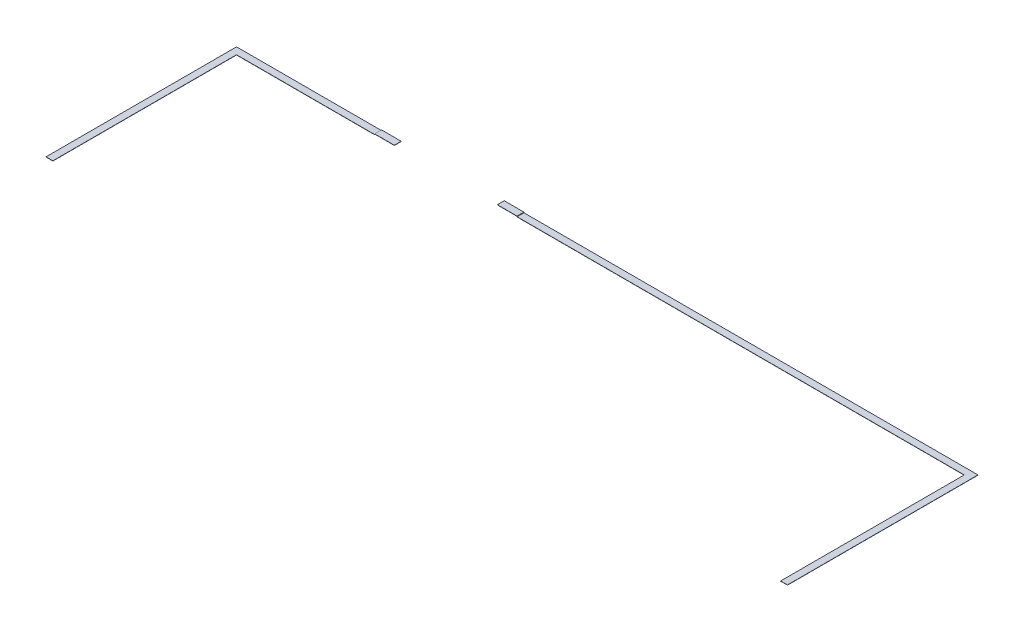
ISO-10303-21;
HEADER;
FILE_DESCRIPTION(('STEP AP214'),'2;1');
FILE_NAME('part.step','',(''),(''),'','','');
FILE_SCHEMA(('AUTOMOTIVE_DESIGN { 1 0 10303 214 1 1 1 1 }'));
ENDSEC;
DATA;
#1=APPLICATION_CONTEXT('core data for automotive mechanical design processes');
#2=APPLICATION_PROTOCOL_DEFINITION('international standard','automotive_design',2000,#1);
#3=PRODUCT_CONTEXT('',#1,'mechanical');
#4=PRODUCT('Part','Part','',(#3));
#5=PRODUCT_RELATED_PRODUCT_CATEGORY('part','',(#4));
#6=PRODUCT_DEFINITION_FORMATION('','',#4);
#7=PRODUCT_DEFINITION_CONTEXT('part definition',#1,'design');
#8=PRODUCT_DEFINITION('design','',#6,#7);
#9=PRODUCT_DEFINITION_SHAPE('','',#8);
#10=(LENGTH_UNIT() NAMED_UNIT(*) SI_UNIT(.MILLI.,.METRE.));
#11=(NAMED_UNIT(*) PLANE_ANGLE_UNIT() SI_UNIT($,.RADIAN.));
#12=(NAMED_UNIT(*) SI_UNIT($,.STERADIAN.) SOLID_ANGLE_UNIT());
#13=UNCERTAINTY_MEASURE_WITH_UNIT(LENGTH_MEASURE(1.E-05),#10,'distance_accuracy_value','');
#14=(GEOMETRIC_REPRESENTATION_CONTEXT(3) GLOBAL_UNCERTAINTY_ASSIGNED_CONTEXT((#13)) GLOBAL_UNIT_ASSIGNED_CONTEXT((#10,
#11,#12)) REPRESENTATION_CONTEXT('',''));
#15=CARTESIAN_POINT('',(0.,0.,0.));
#16=DIRECTION('',(0.,0.,1.));
#17=DIRECTION('',(1.,0.,0.));
#18=AXIS2_PLACEMENT_3D('',#15,#16,#17);
#19=CARTESIAN_POINT('',(2126.7166,5.8293,-1409.7));
#20=DIRECTION('',(1.,0.,0.));
#21=DIRECTION('',(0.,0.,-1.));
#22=AXIS2_PLACEMENT_3D('',#19,#20,#21);
#23=PLANE('',#22);
#24=DIRECTION('',(0.,0.,1.));
#25=VECTOR('',#24,1.);
#26=CARTESIAN_POINT('',(2126.7166,4.2418,-1409.7));
#27=LINE('',#26,#25);
#28=CARTESIAN_POINT('',(2126.7166,4.2418,-1409.7));
#29=VERTEX_POINT('',#28);
#30=CARTESIAN_POINT('',(2126.7166,4.2418,-1358.9));
#31=VERTEX_POINT('',#30);
#32=EDGE_CURVE('E110',#29,#31,#27,.T.);
#33=ORIENTED_EDGE('',*,*,#32,.F.);
#34=DIRECTION('',(0.,-1.,0.));
#35=VECTOR('',#34,1.);
#36=CARTESIAN_POINT('',(2126.7166,5.8293,-1409.7));
#37=LINE('',#36,#35);
#38=CARTESIAN_POINT('',(2126.7166,5.8293,-1409.7));
#39=VERTEX_POINT('',#38);
#40=EDGE_CURVE('E12',#39,#29,#37,.T.);
#41=ORIENTED_EDGE('',*,*,#40,.F.);
#42=DIRECTION('',(0.,0.,1.));
#43=VECTOR('',#42,1.);
#44=CARTESIAN_POINT('',(2126.7166,5.8293,-1409.7));
#45=LINE('',#44,#43);
#46=CARTESIAN_POINT('',(2126.7166,5.8293,-1358.9));
#47=VERTEX_POINT('',#46);
#48=EDGE_CURVE('E104',#39,#47,#45,.T.);
#49=ORIENTED_EDGE('',*,*,#48,.T.);
#50=DIRECTION('',(0.,-1.,0.));
#51=VECTOR('',#50,1.);
#52=CARTESIAN_POINT('',(2126.7166,5.8293,-1358.9));
#53=LINE('',#52,#51);
#54=EDGE_CURVE('E49',#47,#31,#53,.T.);
#55=ORIENTED_EDGE('',*,*,#54,.T.);
#56=EDGE_LOOP('',(#33,#41,#49,#55));
#57=FACE_BOUND('',#56,.T.);
#58=ADVANCED_FACE('F46',(#57),#23,.T.);
#59=CARTESIAN_POINT('',(2126.7166,5.8293,-1409.7));
#60=DIRECTION('',(0.,0.,-1.));
#61=DIRECTION('',(-1.,0.,0.));
#62=AXIS2_PLACEMENT_3D('',#59,#60,#61);
#63=PLANE('',#62);
#64=DIRECTION('',(1.,0.,0.));
#65=VECTOR('',#64,1.);
#66=CARTESIAN_POINT('',(2126.7166,4.2418,-1409.7));
#67=LINE('',#66,#65);
#68=CARTESIAN_POINT('',(1980.6666,4.2418,-1409.7));
#69=VERTEX_POINT('',#68);
#70=EDGE_CURVE('E106',#69,#29,#67,.T.);
#71=ORIENTED_EDGE('',*,*,#70,.F.);
#72=DIRECTION('',(0.,-1.,0.));
#73=VECTOR('',#72,1.);
#74=CARTESIAN_POINT('',(1980.6666,5.8293,-1409.7));
#75=LINE('',#74,#73);
#76=CARTESIAN_POINT('',(1980.6666,5.8293,-1409.7));
#77=VERTEX_POINT('',#76);
#78=EDGE_CURVE('E55',#77,#69,#75,.T.);
#79=ORIENTED_EDGE('',*,*,#78,.F.);
#80=DIRECTION('',(1.,0.,0.));
#81=VECTOR('',#80,1.);
#82=CARTESIAN_POINT('',(2126.7166,5.8293,-1409.7));
#83=LINE('',#82,#81);
#84=EDGE_CURVE('E101',#77,#39,#83,.T.);
#85=ORIENTED_EDGE('',*,*,#84,.T.);
#86=ORIENTED_EDGE('',*,*,#40,.T.);
#87=EDGE_LOOP('',(#71,#79,#85,#86));
#88=FACE_BOUND('',#87,.T.);
#89=ADVANCED_FACE('F120',(#88),#63,.T.);
#90=CARTESIAN_POINT('',(1980.6666,5.8293,-1409.7));
#91=DIRECTION('',(-1.,0.,0.));
#92=DIRECTION('',(0.,0.,1.));
#93=AXIS2_PLACEMENT_3D('',#90,#91,#92);
#94=PLANE('',#93);
#95=DIRECTION('',(0.,0.,-1.));
#96=VECTOR('',#95,1.);
#97=CARTESIAN_POINT('',(1980.6666,4.2418,-1409.7));
#98=LINE('',#97,#96);
#99=CARTESIAN_POINT('',(1980.6666,4.2418,-1358.9));
#100=VERTEX_POINT('',#99);
#101=EDGE_CURVE('E96',#100,#69,#98,.T.);
#102=ORIENTED_EDGE('',*,*,#101,.F.);
#103=DIRECTION('',(0.,-1.,0.));
#104=VECTOR('',#103,1.);
#105=CARTESIAN_POINT('',(1980.6666,5.8293,-1358.9));
#106=LINE('',#105,#104);
#107=CARTESIAN_POINT('',(1980.6666,5.8293,-1358.9));
#108=VERTEX_POINT('',#107);
#109=EDGE_CURVE('E91',#108,#100,#106,.T.);
#110=ORIENTED_EDGE('',*,*,#109,.F.);
#111=DIRECTION('',(0.,0.,-1.));
#112=VECTOR('',#111,1.);
#113=CARTESIAN_POINT('',(1980.6666,5.8293,-1409.7));
#114=LINE('',#113,#112);
#115=EDGE_CURVE('E94',#108,#77,#114,.T.);
#116=ORIENTED_EDGE('',*,*,#115,.T.);
#117=ORIENTED_EDGE('',*,*,#78,.T.);
#118=EDGE_LOOP('',(#102,#110,#116,#117));
#119=FACE_BOUND('',#118,.T.);
#120=ADVANCED_FACE('F93',(#119),#94,.T.);
#121=CARTESIAN_POINT('',(2126.7166,5.8293,-1358.9));
#122=DIRECTION('',(0.,0.,1.));
#123=DIRECTION('',(1.,0.,0.));
#124=AXIS2_PLACEMENT_3D('',#121,#122,#123);
#125=PLANE('',#124);
#126=DIRECTION('',(-1.,0.,0.));
#127=VECTOR('',#126,1.);
#128=CARTESIAN_POINT('',(2126.7166,4.2418,-1358.9));
#129=LINE('',#128,#127);
#130=EDGE_CURVE('E113',#31,#100,#129,.T.);
#131=ORIENTED_EDGE('',*,*,#130,.F.);
#132=ORIENTED_EDGE('',*,*,#54,.F.);
#133=DIRECTION('',(-1.,0.,0.));
#134=VECTOR('',#133,1.);
#135=CARTESIAN_POINT('',(2126.7166,5.8293,-1358.9));
#136=LINE('',#135,#134);
#137=EDGE_CURVE('E100',#47,#108,#136,.T.);
#138=ORIENTED_EDGE('',*,*,#137,.T.);
#139=ORIENTED_EDGE('',*,*,#109,.T.);
#140=EDGE_LOOP('',(#131,#132,#138,#139));
#141=FACE_BOUND('',#140,.T.);
#142=ADVANCED_FACE('F103',(#141),#125,.T.);
#143=CARTESIAN_POINT('',(0.,5.8293,0.));
#144=DIRECTION('',(0.,-1.,0.));
#145=DIRECTION('',(0.,0.,-1.));
#146=AXIS2_PLACEMENT_3D('',#143,#144,#145);
#147=PLANE('',#146);
#148=ORIENTED_EDGE('',*,*,#48,.F.);
#149=ORIENTED_EDGE('',*,*,#84,.F.);
#150=ORIENTED_EDGE('',*,*,#115,.F.);
#151=ORIENTED_EDGE('',*,*,#137,.F.);
#152=EDGE_LOOP('',(#148,#149,#150,#151));
#153=FACE_BOUND('',#152,.T.);
#154=ADVANCED_FACE('F99',(#153),#147,.F.);
#155=CARTESIAN_POINT('',(0.,4.2418,0.));
#156=DIRECTION('',(0.,-1.,0.));
#157=DIRECTION('',(0.,0.,-1.));
#158=AXIS2_PLACEMENT_3D('',#155,#156,#157);
#159=PLANE('',#158);
#160=ORIENTED_EDGE('',*,*,#32,.T.);
#161=ORIENTED_EDGE('',*,*,#130,.T.);
#162=ORIENTED_EDGE('',*,*,#101,.T.);
#163=ORIENTED_EDGE('',*,*,#70,.T.);
#164=EDGE_LOOP('',(#160,#161,#162,#163));
#165=FACE_BOUND('',#164,.T.);
#166=ADVANCED_FACE('F119',(#165),#159,.T.);
#167=CLOSED_SHELL('',(#58,#89,#120,#142,#154,#166));
#168=MANIFOLD_SOLID_BREP('B2',#167);
#169=CARTESIAN_POINT('',(1072.6166,5.8293,-1409.7));
#170=DIRECTION('',(-1.,0.,0.));
#171=DIRECTION('',(0.,0.,1.));
#172=AXIS2_PLACEMENT_3D('',#169,#170,#171);
#173=PLANE('',#172);
#174=DIRECTION('',(0.,0.,-1.));
#175=VECTOR('',#174,1.);
#176=CARTESIAN_POINT('',(1072.6166,4.2418,-1409.7));
#177=LINE('',#176,#175);
#178=CARTESIAN_POINT('',(1072.6166,4.2418,-1358.9));
#179=VERTEX_POINT('',#178);
#180=CARTESIAN_POINT('',(1072.6166,4.2418,-1409.7));
#181=VERTEX_POINT('',#180);
#182=EDGE_CURVE('E244',#179,#181,#177,.T.);
#183=ORIENTED_EDGE('',*,*,#182,.F.);
#184=DIRECTION('',(0.,-1.,0.));
#185=VECTOR('',#184,1.);
#186=CARTESIAN_POINT('',(1072.6166,5.8293,-1358.9));
#187=LINE('',#186,#185);
#188=CARTESIAN_POINT('',(1072.6166,5.8293,-1358.9));
#189=VERTEX_POINT('',#188);
#190=EDGE_CURVE('E44',#189,#179,#187,.T.);
#191=ORIENTED_EDGE('',*,*,#190,.F.);
#192=DIRECTION('',(0.,0.,-1.));
#193=VECTOR('',#192,1.);
#194=CARTESIAN_POINT('',(1072.6166,5.8293,-1409.7));
#195=LINE('',#194,#193);
#196=CARTESIAN_POINT('',(1072.6166,5.8293,-1409.7));
#197=VERTEX_POINT('',#196);
#198=EDGE_CURVE('E238',#189,#197,#195,.T.);
#199=ORIENTED_EDGE('',*,*,#198,.T.);
#200=DIRECTION('',(0.,-1.,0.));
#201=VECTOR('',#200,1.);
#202=CARTESIAN_POINT('',(1072.6166,5.8293,-1409.7));
#203=LINE('',#202,#201);
#204=EDGE_CURVE('E183',#197,#181,#203,.T.);
#205=ORIENTED_EDGE('',*,*,#204,.T.);
#206=EDGE_LOOP('',(#183,#191,#199,#205));
#207=FACE_BOUND('',#206,.T.);
#208=ADVANCED_FACE('F180',(#207),#173,.T.);
#209=CARTESIAN_POINT('',(1072.6166,5.8293,-1358.9));
#210=DIRECTION('',(0.,0.,1.));
#211=DIRECTION('',(1.,0.,0.));
#212=AXIS2_PLACEMENT_3D('',#209,#210,#211);
#213=PLANE('',#212);
#214=DIRECTION('',(-1.,0.,0.));
#215=VECTOR('',#214,1.);
#216=CARTESIAN_POINT('',(1072.6166,4.2418,-1358.9));
#217=LINE('',#216,#215);
#218=CARTESIAN_POINT('',(1218.6666,4.2418,-1358.9));
#219=VERTEX_POINT('',#218);
#220=EDGE_CURVE('E240',#219,#179,#217,.T.);
#221=ORIENTED_EDGE('',*,*,#220,.F.);
#222=DIRECTION('',(0.,-1.,0.));
#223=VECTOR('',#222,1.);
#224=CARTESIAN_POINT('',(1218.6666,5.8293,-1358.9));
#225=LINE('',#224,#223);
#226=CARTESIAN_POINT('',(1218.6666,5.8293,-1358.9));
#227=VERTEX_POINT('',#226);
#228=EDGE_CURVE('E189',#227,#219,#225,.T.);
#229=ORIENTED_EDGE('',*,*,#228,.F.);
#230=DIRECTION('',(-1.,0.,0.));
#231=VECTOR('',#230,1.);
#232=CARTESIAN_POINT('',(1072.6166,5.8293,-1358.9));
#233=LINE('',#232,#231);
#234=EDGE_CURVE('E235',#227,#189,#233,.T.);
#235=ORIENTED_EDGE('',*,*,#234,.T.);
#236=ORIENTED_EDGE('',*,*,#190,.T.);
#237=EDGE_LOOP('',(#221,#229,#235,#236));
#238=FACE_BOUND('',#237,.T.);
#239=ADVANCED_FACE('F254',(#238),#213,.T.);
#240=CARTESIAN_POINT('',(1218.6666,5.8293,-1409.7));
#241=DIRECTION('',(1.,0.,0.));
#242=DIRECTION('',(0.,0.,-1.));
#243=AXIS2_PLACEMENT_3D('',#240,#241,#242);
#244=PLANE('',#243);
#245=DIRECTION('',(0.,0.,1.));
#246=VECTOR('',#245,1.);
#247=CARTESIAN_POINT('',(1218.6666,4.2418,-1409.7));
#248=LINE('',#247,#246);
#249=CARTESIAN_POINT('',(1218.6666,4.2418,-1409.7));
#250=VERTEX_POINT('',#249);
#251=EDGE_CURVE('E230',#250,#219,#248,.T.);
#252=ORIENTED_EDGE('',*,*,#251,.F.);
#253=DIRECTION('',(0.,-1.,0.));
#254=VECTOR('',#253,1.);
#255=CARTESIAN_POINT('',(1218.6666,5.8293,-1409.7));
#256=LINE('',#255,#254);
#257=CARTESIAN_POINT('',(1218.6666,5.8293,-1409.7));
#258=VERTEX_POINT('',#257);
#259=EDGE_CURVE('E225',#258,#250,#256,.T.);
#260=ORIENTED_EDGE('',*,*,#259,.F.);
#261=DIRECTION('',(0.,0.,1.));
#262=VECTOR('',#261,1.);
#263=CARTESIAN_POINT('',(1218.6666,5.8293,-1409.7));
#264=LINE('',#263,#262);
#265=EDGE_CURVE('E228',#258,#227,#264,.T.);
#266=ORIENTED_EDGE('',*,*,#265,.T.);
#267=ORIENTED_EDGE('',*,*,#228,.T.);
#268=EDGE_LOOP('',(#252,#260,#266,#267));
#269=FACE_BOUND('',#268,.T.);
#270=ADVANCED_FACE('F227',(#269),#244,.T.);
#271=CARTESIAN_POINT('',(1072.6166,5.8293,-1409.7));
#272=DIRECTION('',(0.,0.,-1.));
#273=DIRECTION('',(-1.,0.,0.));
#274=AXIS2_PLACEMENT_3D('',#271,#272,#273);
#275=PLANE('',#274);
#276=DIRECTION('',(1.,0.,0.));
#277=VECTOR('',#276,1.);
#278=CARTESIAN_POINT('',(1072.6166,4.2418,-1409.7));
#279=LINE('',#278,#277);
#280=EDGE_CURVE('E247',#181,#250,#279,.T.);
#281=ORIENTED_EDGE('',*,*,#280,.F.);
#282=ORIENTED_EDGE('',*,*,#204,.F.);
#283=DIRECTION('',(1.,0.,0.));
#284=VECTOR('',#283,1.);
#285=CARTESIAN_POINT('',(1072.6166,5.8293,-1409.7));
#286=LINE('',#285,#284);
#287=EDGE_CURVE('E234',#197,#258,#286,.T.);
#288=ORIENTED_EDGE('',*,*,#287,.T.);
#289=ORIENTED_EDGE('',*,*,#259,.T.);
#290=EDGE_LOOP('',(#281,#282,#288,#289));
#291=FACE_BOUND('',#290,.T.);
#292=ADVANCED_FACE('F237',(#291),#275,.T.);
#293=CARTESIAN_POINT('',(0.,5.8293,0.));
#294=DIRECTION('',(0.,1.,0.));
#295=DIRECTION('',(0.,0.,1.));
#296=AXIS2_PLACEMENT_3D('',#293,#294,#295);
#297=PLANE('',#296);
#298=ORIENTED_EDGE('',*,*,#198,.F.);
#299=ORIENTED_EDGE('',*,*,#234,.F.);
#300=ORIENTED_EDGE('',*,*,#265,.F.);
#301=ORIENTED_EDGE('',*,*,#287,.F.);
#302=EDGE_LOOP('',(#298,#299,#300,#301));
#303=FACE_BOUND('',#302,.T.);
#304=ADVANCED_FACE('F233',(#303),#297,.T.);
#305=CARTESIAN_POINT('',(0.,4.2418,0.));
#306=DIRECTION('',(0.,1.,0.));
#307=DIRECTION('',(0.,0.,1.));
#308=AXIS2_PLACEMENT_3D('',#305,#306,#307);
#309=PLANE('',#308);
#310=ORIENTED_EDGE('',*,*,#182,.T.);
#311=ORIENTED_EDGE('',*,*,#280,.T.);
#312=ORIENTED_EDGE('',*,*,#251,.T.);
#313=ORIENTED_EDGE('',*,*,#220,.T.);
#314=EDGE_LOOP('',(#310,#311,#312,#313));
#315=FACE_BOUND('',#314,.T.);
#316=ADVANCED_FACE('F253',(#315),#309,.F.);
#317=CLOSED_SHELL('',(#208,#239,#270,#292,#304,#316));
#318=MANIFOLD_SOLID_BREP('B6',#317);
#319=CARTESIAN_POINT('',(5435.6,1.5875,-1358.9));
#320=DIRECTION('',(1.,0.,0.));
#321=DIRECTION('',(0.,0.,-1.));
#322=AXIS2_PLACEMENT_3D('',#319,#320,#321);
#323=PLANE('',#322);
#324=DIRECTION('',(0.,0.,1.));
#325=VECTOR('',#324,1.);
#326=CARTESIAN_POINT('',(5435.6,0.,-1358.9));
#327=LINE('',#326,#325);
#328=CARTESIAN_POINT('',(5435.6,0.,-1358.9));
#329=VERTEX_POINT('',#328);
#330=CARTESIAN_POINT('',(5435.6,0.,0.));
#331=VERTEX_POINT('',#330);
#332=EDGE_CURVE('E387',#329,#331,#327,.T.);
#333=ORIENTED_EDGE('',*,*,#332,.T.);
#334=DIRECTION('',(0.,-1.,0.));
#335=VECTOR('',#334,1.);
#336=CARTESIAN_POINT('',(5435.6,1.5875,0.));
#337=LINE('',#336,#335);
#338=CARTESIAN_POINT('',(5435.6,1.5875,0.));
#339=VERTEX_POINT('',#338);
#340=EDGE_CURVE('E320',#339,#331,#337,.T.);
#341=ORIENTED_EDGE('',*,*,#340,.F.);
#342=DIRECTION('',(0.,0.,1.));
#343=VECTOR('',#342,1.);
#344=CARTESIAN_POINT('',(5435.6,1.5875,-1358.9));
#345=LINE('',#344,#343);
#346=CARTESIAN_POINT('',(5435.6,1.5875,-1358.9));
#347=VERTEX_POINT('',#346);
#348=EDGE_CURVE('E417',#347,#339,#345,.T.);
#349=ORIENTED_EDGE('',*,*,#348,.F.);
#350=DIRECTION('',(0.,-1.,0.));
#351=VECTOR('',#350,1.);
#352=CARTESIAN_POINT('',(5435.6,1.5875,-1358.9));
#353=LINE('',#352,#351);
#354=EDGE_CURVE('E178',#347,#329,#353,.T.);
#355=ORIENTED_EDGE('',*,*,#354,.T.);
#356=EDGE_LOOP('',(#333,#341,#349,#355));
#357=FACE_BOUND('',#356,.T.);
#358=ADVANCED_FACE('F312',(#357),#323,.F.);
#359=CARTESIAN_POINT('',(5435.6,1.5875,0.));
#360=DIRECTION('',(0.,0.,-1.));
#361=DIRECTION('',(-1.,0.,0.));
#362=AXIS2_PLACEMENT_3D('',#359,#360,#361);
#363=PLANE('',#362);
#364=DIRECTION('',(1.,0.,0.));
#365=VECTOR('',#364,1.);
#366=CARTESIAN_POINT('',(5435.6,0.,0.));
#367=LINE('',#366,#365);
#368=CARTESIAN_POINT('',(5486.4,0.,0.));
#369=VERTEX_POINT('',#368);
#370=EDGE_CURVE('E390',#331,#369,#367,.T.);
#371=ORIENTED_EDGE('',*,*,#370,.T.);
#372=DIRECTION('',(0.,-1.,0.));
#373=VECTOR('',#372,1.);
#374=CARTESIAN_POINT('',(5486.4,1.5875,0.));
#375=LINE('',#374,#373);
#376=CARTESIAN_POINT('',(5486.4,1.5875,0.));
#377=VERTEX_POINT('',#376);
#378=EDGE_CURVE('E403',#377,#369,#375,.T.);
#379=ORIENTED_EDGE('',*,*,#378,.F.);
#380=DIRECTION('',(1.,0.,0.));
#381=VECTOR('',#380,1.);
#382=CARTESIAN_POINT('',(5435.6,1.5875,0.));
#383=LINE('',#382,#381);
#384=EDGE_CURVE('E410',#339,#377,#383,.T.);
#385=ORIENTED_EDGE('',*,*,#384,.F.);
#386=ORIENTED_EDGE('',*,*,#340,.T.);
#387=EDGE_LOOP('',(#371,#379,#385,#386));
#388=FACE_BOUND('',#387,.T.);
#389=ADVANCED_FACE('F408',(#388),#363,.F.);
#390=CARTESIAN_POINT('',(5486.4,1.5875,-1409.7));
#391=DIRECTION('',(-1.,0.,0.));
#392=DIRECTION('',(0.,0.,1.));
#393=AXIS2_PLACEMENT_3D('',#390,#391,#392);
#394=PLANE('',#393);
#395=DIRECTION('',(0.,0.,-1.));
#396=VECTOR('',#395,1.);
#397=CARTESIAN_POINT('',(5486.4,0.,-1409.7));
#398=LINE('',#397,#396);
#399=CARTESIAN_POINT('',(5486.4,0.,-1409.7));
#400=VERTEX_POINT('',#399);
#401=EDGE_CURVE('E357',#369,#400,#398,.T.);
#402=ORIENTED_EDGE('',*,*,#401,.T.);
#403=DIRECTION('',(0.,-1.,0.));
#404=VECTOR('',#403,1.);
#405=CARTESIAN_POINT('',(5486.4,1.5875,-1409.7));
#406=LINE('',#405,#404);
#407=CARTESIAN_POINT('',(5486.4,1.5875,-1409.7));
#408=VERTEX_POINT('',#407);
#409=EDGE_CURVE('E401',#408,#400,#406,.T.);
#410=ORIENTED_EDGE('',*,*,#409,.F.);
#411=DIRECTION('',(0.,0.,-1.));
#412=VECTOR('',#411,1.);
#413=CARTESIAN_POINT('',(5486.4,1.5875,-1409.7));
#414=LINE('',#413,#412);
#415=EDGE_CURVE('E336',#377,#408,#414,.T.);
#416=ORIENTED_EDGE('',*,*,#415,.F.);
#417=ORIENTED_EDGE('',*,*,#378,.T.);
#418=EDGE_LOOP('',(#402,#410,#416,#417));
#419=FACE_BOUND('',#418,.T.);
#420=ADVANCED_FACE('F416',(#419),#394,.F.);
#421=CARTESIAN_POINT('',(0.,1.5875,0.));
#422=DIRECTION('',(0.,-1.,0.));
#423=DIRECTION('',(0.,0.,-1.));
#424=AXIS2_PLACEMENT_3D('',#421,#422,#423);
#425=PLANE('',#424);
#426=DIRECTION('',(-1.,0.,0.));
#427=VECTOR('',#426,1.);
#428=CARTESIAN_POINT('',(0.,1.5875,-1409.7));
#429=LINE('',#428,#427);
#430=CARTESIAN_POINT('',(2126.7166,1.5875,-1409.7));
#431=VERTEX_POINT('',#430);
#432=EDGE_CURVE('E394',#408,#431,#429,.T.);
#433=ORIENTED_EDGE('',*,*,#432,.T.);
#434=DIRECTION('',(0.,0.,1.));
#435=VECTOR('',#434,1.);
#436=CARTESIAN_POINT('',(2126.7166,1.5875,0.));
#437=LINE('',#436,#435);
#438=CARTESIAN_POINT('',(2126.7166,1.5875,-1358.9));
#439=VERTEX_POINT('',#438);
#440=EDGE_CURVE('E388',#431,#439,#437,.T.);
#441=ORIENTED_EDGE('',*,*,#440,.T.);
#442=DIRECTION('',(1.,0.,0.));
#443=VECTOR('',#442,1.);
#444=CARTESIAN_POINT('',(50.8,1.5875,-1358.9));
#445=LINE('',#444,#443);
#446=EDGE_CURVE('E364',#439,#347,#445,.T.);
#447=ORIENTED_EDGE('',*,*,#446,.T.);
#448=ORIENTED_EDGE('',*,*,#348,.T.);
#449=ORIENTED_EDGE('',*,*,#384,.T.);
#450=ORIENTED_EDGE('',*,*,#415,.T.);
#451=EDGE_LOOP('',(#433,#441,#447,#448,#449,#450));
#452=FACE_BOUND('',#451,.T.);
#453=ADVANCED_FACE('F422',(#452),#425,.F.);
#454=CARTESIAN_POINT('',(0.,0.,0.));
#455=DIRECTION('',(0.,-1.,0.));
#456=DIRECTION('',(0.,0.,-1.));
#457=AXIS2_PLACEMENT_3D('',#454,#455,#456);
#458=PLANE('',#457);
#459=DIRECTION('',(0.,0.,-1.));
#460=VECTOR('',#459,1.);
#461=CARTESIAN_POINT('',(2126.7166,0.,-1409.7));
#462=LINE('',#461,#460);
#463=CARTESIAN_POINT('',(2126.7166,0.,-1358.9));
#464=VERTEX_POINT('',#463);
#465=CARTESIAN_POINT('',(2126.7166,0.,-1409.7));
#466=VERTEX_POINT('',#465);
#467=EDGE_CURVE('E372',#464,#466,#462,.T.);
#468=ORIENTED_EDGE('',*,*,#467,.T.);
#469=DIRECTION('',(-1.,0.,0.));
#470=VECTOR('',#469,1.);
#471=CARTESIAN_POINT('',(0.,0.,-1409.7));
#472=LINE('',#471,#470);
#473=EDGE_CURVE('E399',#400,#466,#472,.T.);
#474=ORIENTED_EDGE('',*,*,#473,.F.);
#475=ORIENTED_EDGE('',*,*,#401,.F.);
#476=ORIENTED_EDGE('',*,*,#370,.F.);
#477=ORIENTED_EDGE('',*,*,#332,.F.);
#478=DIRECTION('',(1.,0.,0.));
#479=VECTOR('',#478,1.);
#480=CARTESIAN_POINT('',(50.8,0.,-1358.9));
#481=LINE('',#480,#479);
#482=EDGE_CURVE('E382',#464,#329,#481,.T.);
#483=ORIENTED_EDGE('',*,*,#482,.F.);
#484=EDGE_LOOP('',(#468,#474,#475,#476,#477,#483));
#485=FACE_BOUND('',#484,.T.);
#486=ADVANCED_FACE('F385',(#485),#458,.T.);
#487=CARTESIAN_POINT('',(0.,1.5875,-1409.7));
#488=DIRECTION('',(0.,0.,1.));
#489=DIRECTION('',(1.,0.,0.));
#490=AXIS2_PLACEMENT_3D('',#487,#488,#489);
#491=PLANE('',#490);
#492=ORIENTED_EDGE('',*,*,#473,.T.);
#493=DIRECTION('',(0.,1.,0.));
#494=VECTOR('',#493,1.);
#495=CARTESIAN_POINT('',(2126.7166,0.,-1409.7));
#496=LINE('',#495,#494);
#497=EDGE_CURVE('E327',#466,#431,#496,.T.);
#498=ORIENTED_EDGE('',*,*,#497,.T.);
#499=ORIENTED_EDGE('',*,*,#432,.F.);
#500=ORIENTED_EDGE('',*,*,#409,.T.);
#501=EDGE_LOOP('',(#492,#498,#499,#500));
#502=FACE_BOUND('',#501,.T.);
#503=ADVANCED_FACE('F414',(#502),#491,.F.);
#504=CARTESIAN_POINT('',(50.8,1.5875,-1358.9));
#505=DIRECTION('',(0.,0.,-1.));
#506=DIRECTION('',(-1.,0.,0.));
#507=AXIS2_PLACEMENT_3D('',#504,#505,#506);
#508=PLANE('',#507);
#509=ORIENTED_EDGE('',*,*,#446,.F.);
#510=DIRECTION('',(0.,1.,0.));
#511=VECTOR('',#510,1.);
#512=CARTESIAN_POINT('',(2126.7166,0.,-1358.9));
#513=LINE('',#512,#511);
#514=EDGE_CURVE('E375',#464,#439,#513,.T.);
#515=ORIENTED_EDGE('',*,*,#514,.F.);
#516=ORIENTED_EDGE('',*,*,#482,.T.);
#517=ORIENTED_EDGE('',*,*,#354,.F.);
#518=EDGE_LOOP('',(#509,#515,#516,#517));
#519=FACE_BOUND('',#518,.T.);
#520=ADVANCED_FACE('F314',(#519),#508,.F.);
#521=CARTESIAN_POINT('',(2126.7166,0.,-1409.7));
#522=DIRECTION('',(1.,0.,0.));
#523=DIRECTION('',(0.,0.,-1.));
#524=AXIS2_PLACEMENT_3D('',#521,#522,#523);
#525=PLANE('',#524);
#526=ORIENTED_EDGE('',*,*,#497,.F.);
#527=ORIENTED_EDGE('',*,*,#467,.F.);
#528=ORIENTED_EDGE('',*,*,#514,.T.);
#529=ORIENTED_EDGE('',*,*,#440,.F.);
#530=EDGE_LOOP('',(#526,#527,#528,#529));
#531=FACE_BOUND('',#530,.T.);
#532=ADVANCED_FACE('F374',(#531),#525,.F.);
#533=CLOSED_SHELL('',(#358,#389,#420,#453,#486,#503,#520,#532));
#534=MANIFOLD_SOLID_BREP('B38',#533);
#535=CARTESIAN_POINT('',(50.8,1.5875,-1358.9));
#536=DIRECTION('',(0.,0.,-1.));
#537=DIRECTION('',(-1.,0.,0.));
#538=AXIS2_PLACEMENT_3D('',#535,#536,#537);
#539=PLANE('',#538);
#540=DIRECTION('',(1.,0.,0.));
#541=VECTOR('',#540,1.);
#542=CARTESIAN_POINT('',(50.8,0.,-1358.9));
#543=LINE('',#542,#541);
#544=CARTESIAN_POINT('',(50.8,0.,-1358.9));
#545=VERTEX_POINT('',#544);
#546=CARTESIAN_POINT('',(1072.6166,0.,-1358.9));
#547=VERTEX_POINT('',#546);
#548=EDGE_CURVE('E490',#545,#547,#543,.T.);
#549=ORIENTED_EDGE('',*,*,#548,.T.);
#550=DIRECTION('',(0.,1.,0.));
#551=VECTOR('',#550,1.);
#552=CARTESIAN_POINT('',(1072.6166,0.,-1358.9));
#553=LINE('',#552,#551);
#554=CARTESIAN_POINT('',(1072.6166,1.5875,-1358.9));
#555=VERTEX_POINT('',#554);
#556=EDGE_CURVE('E533',#547,#555,#553,.T.);
#557=ORIENTED_EDGE('',*,*,#556,.T.);
#558=DIRECTION('',(1.,0.,0.));
#559=VECTOR('',#558,1.);
#560=CARTESIAN_POINT('',(50.8,1.5875,-1358.9));
#561=LINE('',#560,#559);
#562=CARTESIAN_POINT('',(50.8,1.5875,-1358.9));
#563=VERTEX_POINT('',#562);
#564=EDGE_CURVE('E556',#563,#555,#561,.T.);
#565=ORIENTED_EDGE('',*,*,#564,.F.);
#566=DIRECTION('',(0.,-1.,0.));
#567=VECTOR('',#566,1.);
#568=CARTESIAN_POINT('',(50.8,1.5875,-1358.9));
#569=LINE('',#568,#567);
#570=EDGE_CURVE('E557',#563,#545,#569,.T.);
#571=ORIENTED_EDGE('',*,*,#570,.T.);
#572=EDGE_LOOP('',(#549,#557,#565,#571));
#573=FACE_BOUND('',#572,.T.);
#574=ADVANCED_FACE('F487',(#573),#539,.F.);
#575=CARTESIAN_POINT('',(0.,1.5875,-1409.7));
#576=DIRECTION('',(0.,0.,1.));
#577=DIRECTION('',(1.,0.,0.));
#578=AXIS2_PLACEMENT_3D('',#575,#576,#577);
#579=PLANE('',#578);
#580=DIRECTION('',(-1.,0.,0.));
#581=VECTOR('',#580,1.);
#582=CARTESIAN_POINT('',(0.,1.5875,-1409.7));
#583=LINE('',#582,#581);
#584=CARTESIAN_POINT('',(1072.6166,1.5875,-1409.7));
#585=VERTEX_POINT('',#584);
#586=CARTESIAN_POINT('',(0.,1.5875,-1409.7));
#587=VERTEX_POINT('',#586);
#588=EDGE_CURVE('E551',#585,#587,#583,.T.);
#589=ORIENTED_EDGE('',*,*,#588,.F.);
#590=DIRECTION('',(0.,1.,0.));
#591=VECTOR('',#590,1.);
#592=CARTESIAN_POINT('',(1072.6166,0.,-1409.7));
#593=LINE('',#592,#591);
#594=CARTESIAN_POINT('',(1072.6166,0.,-1409.7));
#595=VERTEX_POINT('',#594);
#596=EDGE_CURVE('E310',#595,#585,#593,.T.);
#597=ORIENTED_EDGE('',*,*,#596,.F.);
#598=DIRECTION('',(-1.,0.,0.));
#599=VECTOR('',#598,1.);
#600=CARTESIAN_POINT('',(0.,0.,-1409.7));
#601=LINE('',#600,#599);
#602=CARTESIAN_POINT('',(0.,0.,-1409.7));
#603=VERTEX_POINT('',#602);
#604=EDGE_CURVE('E549',#595,#603,#601,.T.);
#605=ORIENTED_EDGE('',*,*,#604,.T.);
#606=DIRECTION('',(0.,-1.,0.));
#607=VECTOR('',#606,1.);
#608=CARTESIAN_POINT('',(0.,1.5875,-1409.7));
#609=LINE('',#608,#607);
#610=EDGE_CURVE('E496',#587,#603,#609,.T.);
#611=ORIENTED_EDGE('',*,*,#610,.F.);
#612=EDGE_LOOP('',(#589,#597,#605,#611));
#613=FACE_BOUND('',#612,.T.);
#614=ADVANCED_FACE('F547',(#613),#579,.F.);
#615=CARTESIAN_POINT('',(0.,1.5875,0.));
#616=DIRECTION('',(0.,-1.,0.));
#617=DIRECTION('',(0.,0.,-1.));
#618=AXIS2_PLACEMENT_3D('',#615,#616,#617);
#619=PLANE('',#618);
#620=ORIENTED_EDGE('',*,*,#564,.T.);
#621=DIRECTION('',(0.,0.,-1.));
#622=VECTOR('',#621,1.);
#623=CARTESIAN_POINT('',(1072.6166,1.5875,0.));
#624=LINE('',#623,#622);
#625=EDGE_CURVE('E503',#555,#585,#624,.T.);
#626=ORIENTED_EDGE('',*,*,#625,.T.);
#627=ORIENTED_EDGE('',*,*,#588,.T.);
#628=DIRECTION('',(0.,0.,1.));
#629=VECTOR('',#628,1.);
#630=CARTESIAN_POINT('',(0.,1.5875,0.));
#631=LINE('',#630,#629);
#632=CARTESIAN_POINT('',(0.,1.5875,0.));
#633=VERTEX_POINT('',#632);
#634=EDGE_CURVE('E563',#587,#633,#631,.T.);
#635=ORIENTED_EDGE('',*,*,#634,.T.);
#636=DIRECTION('',(1.,0.,0.));
#637=VECTOR('',#636,1.);
#638=CARTESIAN_POINT('',(50.8,1.5875,0.));
#639=LINE('',#638,#637);
#640=CARTESIAN_POINT('',(50.8,1.5875,0.));
#641=VERTEX_POINT('',#640);
#642=EDGE_CURVE('E567',#633,#641,#639,.T.);
#643=ORIENTED_EDGE('',*,*,#642,.T.);
#644=DIRECTION('',(0.,0.,-1.));
#645=VECTOR('',#644,1.);
#646=CARTESIAN_POINT('',(50.8,1.5875,0.));
#647=LINE('',#646,#645);
#648=EDGE_CURVE('E543',#641,#563,#647,.T.);
#649=ORIENTED_EDGE('',*,*,#648,.T.);
#650=EDGE_LOOP('',(#620,#626,#627,#635,#643,#649));
#651=FACE_BOUND('',#650,.T.);
#652=ADVANCED_FACE('F594',(#651),#619,.F.);
#653=CARTESIAN_POINT('',(0.,0.,0.));
#654=DIRECTION('',(0.,-1.,0.));
#655=DIRECTION('',(0.,0.,-1.));
#656=AXIS2_PLACEMENT_3D('',#653,#654,#655);
#657=PLANE('',#656);
#658=DIRECTION('',(0.,0.,1.));
#659=VECTOR('',#658,1.);
#660=CARTESIAN_POINT('',(1072.6166,0.,-1409.7));
#661=LINE('',#660,#659);
#662=EDGE_CURVE('E535',#595,#547,#661,.T.);
#663=ORIENTED_EDGE('',*,*,#662,.T.);
#664=ORIENTED_EDGE('',*,*,#548,.F.);
#665=DIRECTION('',(0.,0.,-1.));
#666=VECTOR('',#665,1.);
#667=CARTESIAN_POINT('',(50.8,0.,0.));
#668=LINE('',#667,#666);
#669=CARTESIAN_POINT('',(50.8,0.,0.));
#670=VERTEX_POINT('',#669);
#671=EDGE_CURVE('E575',#670,#545,#668,.T.);
#672=ORIENTED_EDGE('',*,*,#671,.F.);
#673=DIRECTION('',(1.,0.,0.));
#674=VECTOR('',#673,1.);
#675=CARTESIAN_POINT('',(50.8,0.,0.));
#676=LINE('',#675,#674);
#677=CARTESIAN_POINT('',(0.,0.,0.));
#678=VERTEX_POINT('',#677);
#679=EDGE_CURVE('E542',#678,#670,#676,.T.);
#680=ORIENTED_EDGE('',*,*,#679,.F.);
#681=DIRECTION('',(0.,0.,1.));
#682=VECTOR('',#681,1.);
#683=CARTESIAN_POINT('',(0.,0.,0.));
#684=LINE('',#683,#682);
#685=EDGE_CURVE('E555',#603,#678,#684,.T.);
#686=ORIENTED_EDGE('',*,*,#685,.F.);
#687=ORIENTED_EDGE('',*,*,#604,.F.);
#688=EDGE_LOOP('',(#663,#664,#672,#680,#686,#687));
#689=FACE_BOUND('',#688,.T.);
#690=ADVANCED_FACE('F553',(#689),#657,.T.);
#691=CARTESIAN_POINT('',(50.8,1.5875,0.));
#692=DIRECTION('',(0.,0.,-1.));
#693=DIRECTION('',(-1.,0.,0.));
#694=AXIS2_PLACEMENT_3D('',#691,#692,#693);
#695=PLANE('',#694);
#696=ORIENTED_EDGE('',*,*,#679,.T.);
#697=DIRECTION('',(0.,-1.,0.));
#698=VECTOR('',#697,1.);
#699=CARTESIAN_POINT('',(50.8,1.5875,0.));
#700=LINE('',#699,#698);
#701=EDGE_CURVE('E577',#641,#670,#700,.T.);
#702=ORIENTED_EDGE('',*,*,#701,.F.);
#703=ORIENTED_EDGE('',*,*,#642,.F.);
#704=DIRECTION('',(0.,-1.,0.));
#705=VECTOR('',#704,1.);
#706=CARTESIAN_POINT('',(0.,1.5875,0.));
#707=LINE('',#706,#705);
#708=EDGE_CURVE('E574',#633,#678,#707,.T.);
#709=ORIENTED_EDGE('',*,*,#708,.T.);
#710=EDGE_LOOP('',(#696,#702,#703,#709));
#711=FACE_BOUND('',#710,.T.);
#712=ADVANCED_FACE('F589',(#711),#695,.F.);
#713=CARTESIAN_POINT('',(50.8,1.5875,0.));
#714=DIRECTION('',(-1.,0.,0.));
#715=DIRECTION('',(0.,0.,1.));
#716=AXIS2_PLACEMENT_3D('',#713,#714,#715);
#717=PLANE('',#716);
#718=ORIENTED_EDGE('',*,*,#671,.T.);
#719=ORIENTED_EDGE('',*,*,#570,.F.);
#720=ORIENTED_EDGE('',*,*,#648,.F.);
#721=ORIENTED_EDGE('',*,*,#701,.T.);
#722=EDGE_LOOP('',(#718,#719,#720,#721));
#723=FACE_BOUND('',#722,.T.);
#724=ADVANCED_FACE('F585',(#723),#717,.F.);
#725=CARTESIAN_POINT('',(0.,1.5875,0.));
#726=DIRECTION('',(1.,0.,0.));
#727=DIRECTION('',(0.,0.,-1.));
#728=AXIS2_PLACEMENT_3D('',#725,#726,#727);
#729=PLANE('',#728);
#730=ORIENTED_EDGE('',*,*,#685,.T.);
#731=ORIENTED_EDGE('',*,*,#708,.F.);
#732=ORIENTED_EDGE('',*,*,#634,.F.);
#733=ORIENTED_EDGE('',*,*,#610,.T.);
#734=EDGE_LOOP('',(#730,#731,#732,#733));
#735=FACE_BOUND('',#734,.T.);
#736=ADVANCED_FACE('F597',(#735),#729,.F.);
#737=CARTESIAN_POINT('',(1072.6166,0.,-1409.7));
#738=DIRECTION('',(-1.,0.,0.));
#739=DIRECTION('',(0.,0.,1.));
#740=AXIS2_PLACEMENT_3D('',#737,#738,#739);
#741=PLANE('',#740);
#742=ORIENTED_EDGE('',*,*,#556,.F.);
#743=ORIENTED_EDGE('',*,*,#662,.F.);
#744=ORIENTED_EDGE('',*,*,#596,.T.);
#745=ORIENTED_EDGE('',*,*,#625,.F.);
#746=EDGE_LOOP('',(#742,#743,#744,#745));
#747=FACE_BOUND('',#746,.T.);
#748=ADVANCED_FACE('F537',(#747),#741,.F.);
#749=CLOSED_SHELL('',(#574,#614,#652,#690,#712,#724,#736,#748));
#750=MANIFOLD_SOLID_BREP('B172',#749);
#751=ADVANCED_BREP_SHAPE_REPRESENTATION('',(#18,#168,#318,#534,#750),#14);
#752=SHAPE_DEFINITION_REPRESENTATION(#9,#751);
ENDSEC;
END-ISO-10303-21;
